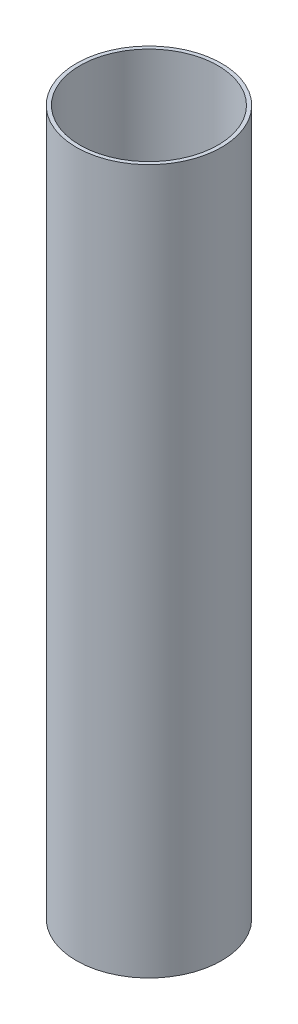
ISO-10303-21;
HEADER;
FILE_DESCRIPTION(('STEP AP214'),'2;1');
FILE_NAME('part.step','',(''),(''),'','','');
FILE_SCHEMA(('AUTOMOTIVE_DESIGN { 1 0 10303 214 1 1 1 1 }'));
ENDSEC;
DATA;
#1=APPLICATION_CONTEXT('core data for automotive mechanical design processes');
#2=APPLICATION_PROTOCOL_DEFINITION('international standard','automotive_design',2000,#1);
#3=PRODUCT_CONTEXT('',#1,'mechanical');
#4=PRODUCT('Part','Part','',(#3));
#5=PRODUCT_RELATED_PRODUCT_CATEGORY('part','',(#4));
#6=PRODUCT_DEFINITION_FORMATION('','',#4);
#7=PRODUCT_DEFINITION_CONTEXT('part definition',#1,'design');
#8=PRODUCT_DEFINITION('design','',#6,#7);
#9=PRODUCT_DEFINITION_SHAPE('','',#8);
#10=(LENGTH_UNIT() NAMED_UNIT(*) SI_UNIT(.MILLI.,.METRE.));
#11=(NAMED_UNIT(*) PLANE_ANGLE_UNIT() SI_UNIT($,.RADIAN.));
#12=(NAMED_UNIT(*) SI_UNIT($,.STERADIAN.) SOLID_ANGLE_UNIT());
#13=UNCERTAINTY_MEASURE_WITH_UNIT(LENGTH_MEASURE(1.E-05),#10,'distance_accuracy_value','');
#14=(GEOMETRIC_REPRESENTATION_CONTEXT(3) GLOBAL_UNCERTAINTY_ASSIGNED_CONTEXT((#13)) GLOBAL_UNIT_ASSIGNED_CONTEXT((#10,
#11,#12)) REPRESENTATION_CONTEXT('',''));
#15=CARTESIAN_POINT('',(0.,0.,0.));
#16=DIRECTION('',(0.,0.,1.));
#17=DIRECTION('',(1.,0.,0.));
#18=AXIS2_PLACEMENT_3D('',#15,#16,#17);
#19=CARTESIAN_POINT('',(0.,453.84466,0.));
#20=DIRECTION('',(0.,1.,0.));
#21=DIRECTION('',(0.,0.,1.));
#22=AXIS2_PLACEMENT_3D('',#19,#20,#21);
#23=PLANE('',#22);
#24=CARTESIAN_POINT('',(0.,453.84466,0.));
#25=DIRECTION('',(0.,1.,0.));
#26=DIRECTION('',(0.,0.,1.));
#27=AXIS2_PLACEMENT_3D('',#24,#25,#26);
#28=CIRCLE('',#27,93.6625);
#29=CARTESIAN_POINT('',(0.,453.84466,93.6625));
#30=VERTEX_POINT('',#29);
#31=EDGE_CURVE('E10',#30,#30,#28,.T.);
#32=ORIENTED_EDGE('',*,*,#31,.T.);
#33=EDGE_LOOP('',(#32));
#34=FACE_BOUND('',#33,.T.);
#35=CARTESIAN_POINT('',(0.,453.84466,0.));
#36=DIRECTION('',(0.,1.,0.));
#37=DIRECTION('',(0.,0.,1.));
#38=AXIS2_PLACEMENT_3D('',#35,#36,#37);
#39=CIRCLE('',#38,88.9);
#40=CARTESIAN_POINT('',(0.,453.84466,88.9));
#41=VERTEX_POINT('',#40);
#42=EDGE_CURVE('E50',#41,#41,#39,.T.);
#43=ORIENTED_EDGE('',*,*,#42,.F.);
#44=EDGE_LOOP('',(#43));
#45=FACE_BOUND('',#44,.T.);
#46=ADVANCED_FACE('F37',(#34,#45),#23,.T.);
#47=CARTESIAN_POINT('',(0.,-453.84466,0.));
#48=DIRECTION('',(0.,1.,0.));
#49=DIRECTION('',(0.,0.,1.));
#50=AXIS2_PLACEMENT_3D('',#47,#48,#49);
#51=PLANE('',#50);
#52=CARTESIAN_POINT('',(0.,-453.84466,0.));
#53=DIRECTION('',(0.,1.,0.));
#54=DIRECTION('',(0.,0.,1.));
#55=AXIS2_PLACEMENT_3D('',#52,#53,#54);
#56=CIRCLE('',#55,93.6625);
#57=CARTESIAN_POINT('',(0.,-453.84466,93.6625));
#58=VERTEX_POINT('',#57);
#59=EDGE_CURVE('E41',#58,#58,#56,.T.);
#60=ORIENTED_EDGE('',*,*,#59,.F.);
#61=EDGE_LOOP('',(#60));
#62=FACE_BOUND('',#61,.T.);
#63=CARTESIAN_POINT('',(0.,-453.84466,0.));
#64=DIRECTION('',(0.,1.,0.));
#65=DIRECTION('',(0.,0.,1.));
#66=AXIS2_PLACEMENT_3D('',#63,#64,#65);
#67=CIRCLE('',#66,88.9);
#68=CARTESIAN_POINT('',(0.,-453.84466,88.9));
#69=VERTEX_POINT('',#68);
#70=EDGE_CURVE('E52',#69,#69,#67,.T.);
#71=ORIENTED_EDGE('',*,*,#70,.T.);
#72=EDGE_LOOP('',(#71));
#73=FACE_BOUND('',#72,.T.);
#74=ADVANCED_FACE('F64',(#62,#73),#51,.F.);
#75=CARTESIAN_POINT('',(0.,453.84466,0.));
#76=DIRECTION('',(0.,-1.,0.));
#77=DIRECTION('',(0.,0.,-1.));
#78=AXIS2_PLACEMENT_3D('',#75,#76,#77);
#79=CYLINDRICAL_SURFACE('',#78,93.6625);
#80=ORIENTED_EDGE('',*,*,#31,.F.);
#81=EDGE_LOOP('',(#80));
#82=FACE_BOUND('',#81,.T.);
#83=ORIENTED_EDGE('',*,*,#59,.T.);
#84=EDGE_LOOP('',(#83));
#85=FACE_BOUND('',#84,.T.);
#86=ADVANCED_FACE('F39',(#82,#85),#79,.T.);
#87=CARTESIAN_POINT('',(0.,453.84466,0.));
#88=DIRECTION('',(0.,-1.,0.));
#89=DIRECTION('',(0.,0.,-1.));
#90=AXIS2_PLACEMENT_3D('',#87,#88,#89);
#91=CYLINDRICAL_SURFACE('',#90,88.9);
#92=ORIENTED_EDGE('',*,*,#42,.T.);
#93=EDGE_LOOP('',(#92));
#94=FACE_BOUND('',#93,.T.);
#95=ORIENTED_EDGE('',*,*,#70,.F.);
#96=EDGE_LOOP('',(#95));
#97=FACE_BOUND('',#96,.T.);
#98=ADVANCED_FACE('F60',(#94,#97),#91,.F.);
#99=CLOSED_SHELL('',(#46,#74,#86,#98));
#100=MANIFOLD_SOLID_BREP('B2',#99);
#101=ADVANCED_BREP_SHAPE_REPRESENTATION('',(#18,#100),#14);
#102=SHAPE_DEFINITION_REPRESENTATION(#9,#101);
ENDSEC;
END-ISO-10303-21;
